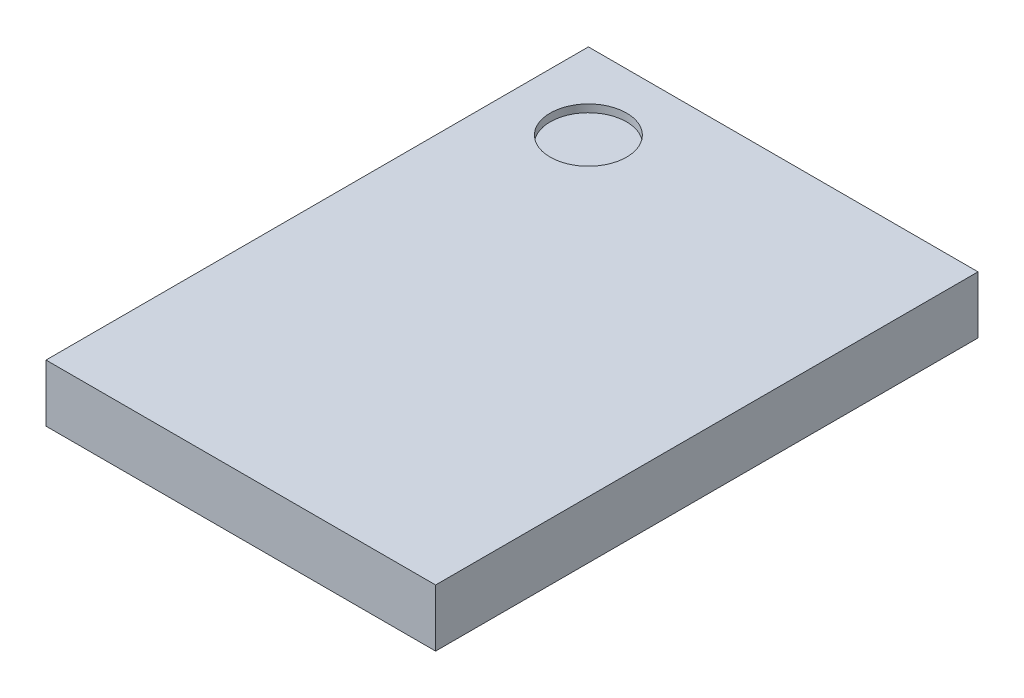
ISO-10303-21;
HEADER;
FILE_DESCRIPTION(('STEP AP214'),'2;1');
FILE_NAME('part.step','',(''),(''),'','','');
FILE_SCHEMA(('AUTOMOTIVE_DESIGN { 1 0 10303 214 1 1 1 1 }'));
ENDSEC;
DATA;
#1=APPLICATION_CONTEXT('core data for automotive mechanical design processes');
#2=APPLICATION_PROTOCOL_DEFINITION('international standard','automotive_design',2000,#1);
#3=PRODUCT_CONTEXT('',#1,'mechanical');
#4=PRODUCT('Part','Part','',(#3));
#5=PRODUCT_RELATED_PRODUCT_CATEGORY('part','',(#4));
#6=PRODUCT_DEFINITION_FORMATION('','',#4);
#7=PRODUCT_DEFINITION_CONTEXT('part definition',#1,'design');
#8=PRODUCT_DEFINITION('design','',#6,#7);
#9=PRODUCT_DEFINITION_SHAPE('','',#8);
#10=(LENGTH_UNIT() NAMED_UNIT(*) SI_UNIT(.MILLI.,.METRE.));
#11=(NAMED_UNIT(*) PLANE_ANGLE_UNIT() SI_UNIT($,.RADIAN.));
#12=(NAMED_UNIT(*) SI_UNIT($,.STERADIAN.) SOLID_ANGLE_UNIT());
#13=UNCERTAINTY_MEASURE_WITH_UNIT(LENGTH_MEASURE(1.E-05),#10,'distance_accuracy_value','');
#14=(GEOMETRIC_REPRESENTATION_CONTEXT(3) GLOBAL_UNCERTAINTY_ASSIGNED_CONTEXT((#13)) GLOBAL_UNIT_ASSIGNED_CONTEXT((#10,
#11,#12)) REPRESENTATION_CONTEXT('',''));
#15=CARTESIAN_POINT('',(0.,0.,0.));
#16=DIRECTION('',(0.,0.,1.));
#17=DIRECTION('',(1.,0.,0.));
#18=AXIS2_PLACEMENT_3D('',#15,#16,#17);
#19=CARTESIAN_POINT('',(2.55,0.75,3.55));
#20=DIRECTION('',(-1.,0.,0.));
#21=DIRECTION('',(0.,0.,1.));
#22=AXIS2_PLACEMENT_3D('',#19,#20,#21);
#23=PLANE('',#22);
#24=DIRECTION('',(0.,0.,-1.));
#25=VECTOR('',#24,1.);
#26=CARTESIAN_POINT('',(2.55,0.,3.55));
#27=LINE('',#26,#25);
#28=CARTESIAN_POINT('',(2.55,0.,3.55));
#29=VERTEX_POINT('',#28);
#30=CARTESIAN_POINT('',(2.55,0.,-3.55));
#31=VERTEX_POINT('',#30);
#32=EDGE_CURVE('E98',#29,#31,#27,.T.);
#33=ORIENTED_EDGE('',*,*,#32,.T.);
#34=DIRECTION('',(0.,-1.,0.));
#35=VECTOR('',#34,1.);
#36=CARTESIAN_POINT('',(2.55,0.75,-3.55));
#37=LINE('',#36,#35);
#38=CARTESIAN_POINT('',(2.55,0.75,-3.55));
#39=VERTEX_POINT('',#38);
#40=EDGE_CURVE('E11',#39,#31,#37,.T.);
#41=ORIENTED_EDGE('',*,*,#40,.F.);
#42=DIRECTION('',(0.,0.,-1.));
#43=VECTOR('',#42,1.);
#44=CARTESIAN_POINT('',(2.55,0.75,3.55));
#45=LINE('',#44,#43);
#46=CARTESIAN_POINT('',(2.55,0.75,3.55));
#47=VERTEX_POINT('',#46);
#48=EDGE_CURVE('E86',#47,#39,#45,.T.);
#49=ORIENTED_EDGE('',*,*,#48,.F.);
#50=DIRECTION('',(0.,-1.,0.));
#51=VECTOR('',#50,1.);
#52=CARTESIAN_POINT('',(2.55,0.75,3.55));
#53=LINE('',#52,#51);
#54=EDGE_CURVE('E94',#47,#29,#53,.T.);
#55=ORIENTED_EDGE('',*,*,#54,.T.);
#56=EDGE_LOOP('',(#33,#41,#49,#55));
#57=FACE_BOUND('',#56,.T.);
#58=ADVANCED_FACE('F35',(#57),#23,.F.);
#59=CARTESIAN_POINT('',(-2.55,0.75,-3.55));
#60=DIRECTION('',(0.,0.,1.));
#61=DIRECTION('',(1.,0.,0.));
#62=AXIS2_PLACEMENT_3D('',#59,#60,#61);
#63=PLANE('',#62);
#64=DIRECTION('',(-1.,0.,0.));
#65=VECTOR('',#64,1.);
#66=CARTESIAN_POINT('',(-2.55,0.,-3.55));
#67=LINE('',#66,#65);
#68=CARTESIAN_POINT('',(-2.55,0.,-3.55));
#69=VERTEX_POINT('',#68);
#70=EDGE_CURVE('E90',#31,#69,#67,.T.);
#71=ORIENTED_EDGE('',*,*,#70,.T.);
#72=DIRECTION('',(0.,-1.,0.));
#73=VECTOR('',#72,1.);
#74=CARTESIAN_POINT('',(-2.55,0.75,-3.55));
#75=LINE('',#74,#73);
#76=CARTESIAN_POINT('',(-2.55,0.75,-3.55));
#77=VERTEX_POINT('',#76);
#78=EDGE_CURVE('E43',#77,#69,#75,.T.);
#79=ORIENTED_EDGE('',*,*,#78,.F.);
#80=DIRECTION('',(-1.,0.,0.));
#81=VECTOR('',#80,1.);
#82=CARTESIAN_POINT('',(-2.55,0.75,-3.55));
#83=LINE('',#82,#81);
#84=EDGE_CURVE('E81',#39,#77,#83,.T.);
#85=ORIENTED_EDGE('',*,*,#84,.F.);
#86=ORIENTED_EDGE('',*,*,#40,.T.);
#87=EDGE_LOOP('',(#71,#79,#85,#86));
#88=FACE_BOUND('',#87,.T.);
#89=ADVANCED_FACE('F89',(#88),#63,.F.);
#90=CARTESIAN_POINT('',(-2.55,0.75,3.55));
#91=DIRECTION('',(1.,0.,0.));
#92=DIRECTION('',(0.,0.,-1.));
#93=AXIS2_PLACEMENT_3D('',#90,#91,#92);
#94=PLANE('',#93);
#95=DIRECTION('',(0.,0.,1.));
#96=VECTOR('',#95,1.);
#97=CARTESIAN_POINT('',(-2.55,0.,3.55));
#98=LINE('',#97,#96);
#99=CARTESIAN_POINT('',(-2.55,0.,3.55));
#100=VERTEX_POINT('',#99);
#101=EDGE_CURVE('E68',#69,#100,#98,.T.);
#102=ORIENTED_EDGE('',*,*,#101,.T.);
#103=DIRECTION('',(0.,-1.,0.));
#104=VECTOR('',#103,1.);
#105=CARTESIAN_POINT('',(-2.55,0.75,3.55));
#106=LINE('',#105,#104);
#107=CARTESIAN_POINT('',(-2.55,0.75,3.55));
#108=VERTEX_POINT('',#107);
#109=EDGE_CURVE('E91',#108,#100,#106,.T.);
#110=ORIENTED_EDGE('',*,*,#109,.F.);
#111=DIRECTION('',(0.,0.,1.));
#112=VECTOR('',#111,1.);
#113=CARTESIAN_POINT('',(-2.55,0.75,3.55));
#114=LINE('',#113,#112);
#115=EDGE_CURVE('E84',#77,#108,#114,.T.);
#116=ORIENTED_EDGE('',*,*,#115,.F.);
#117=ORIENTED_EDGE('',*,*,#78,.T.);
#118=EDGE_LOOP('',(#102,#110,#116,#117));
#119=FACE_BOUND('',#118,.T.);
#120=ADVANCED_FACE('F92',(#119),#94,.F.);
#121=CARTESIAN_POINT('',(-2.55,0.75,3.55));
#122=DIRECTION('',(0.,0.,-1.));
#123=DIRECTION('',(-1.,0.,0.));
#124=AXIS2_PLACEMENT_3D('',#121,#122,#123);
#125=PLANE('',#124);
#126=DIRECTION('',(1.,0.,0.));
#127=VECTOR('',#126,1.);
#128=CARTESIAN_POINT('',(-2.55,0.,3.55));
#129=LINE('',#128,#127);
#130=EDGE_CURVE('E74',#100,#29,#129,.T.);
#131=ORIENTED_EDGE('',*,*,#130,.T.);
#132=ORIENTED_EDGE('',*,*,#54,.F.);
#133=DIRECTION('',(1.,0.,0.));
#134=VECTOR('',#133,1.);
#135=CARTESIAN_POINT('',(-2.55,0.75,3.55));
#136=LINE('',#135,#134);
#137=EDGE_CURVE('E51',#108,#47,#136,.T.);
#138=ORIENTED_EDGE('',*,*,#137,.F.);
#139=ORIENTED_EDGE('',*,*,#109,.T.);
#140=EDGE_LOOP('',(#131,#132,#138,#139));
#141=FACE_BOUND('',#140,.T.);
#142=ADVANCED_FACE('F106',(#141),#125,.F.);
#143=CARTESIAN_POINT('',(0.,0.75,0.));
#144=DIRECTION('',(0.,-1.,0.));
#145=DIRECTION('',(0.,0.,-1.));
#146=AXIS2_PLACEMENT_3D('',#143,#144,#145);
#147=PLANE('',#146);
#148=CARTESIAN_POINT('',(-1.55,0.75,-2.55));
#149=DIRECTION('',(0.,1.,0.));
#150=DIRECTION('',(0.,0.,1.));
#151=AXIS2_PLACEMENT_3D('',#148,#149,#150);
#152=CIRCLE('',#151,0.5);
#153=CARTESIAN_POINT('',(-1.55,0.75,-2.05));
#154=VERTEX_POINT('',#153);
#155=EDGE_CURVE('E112',#154,#154,#152,.T.);
#156=ORIENTED_EDGE('',*,*,#155,.F.);
#157=EDGE_LOOP('',(#156));
#158=FACE_BOUND('',#157,.T.);
#159=ORIENTED_EDGE('',*,*,#48,.T.);
#160=ORIENTED_EDGE('',*,*,#84,.T.);
#161=ORIENTED_EDGE('',*,*,#115,.T.);
#162=ORIENTED_EDGE('',*,*,#137,.T.);
#163=EDGE_LOOP('',(#159,#160,#161,#162));
#164=FACE_BOUND('',#163,.T.);
#165=ADVANCED_FACE('F82',(#158,#164),#147,.F.);
#166=CARTESIAN_POINT('',(0.,0.,0.));
#167=DIRECTION('',(0.,-1.,0.));
#168=DIRECTION('',(0.,0.,-1.));
#169=AXIS2_PLACEMENT_3D('',#166,#167,#168);
#170=PLANE('',#169);
#171=ORIENTED_EDGE('',*,*,#32,.F.);
#172=ORIENTED_EDGE('',*,*,#130,.F.);
#173=ORIENTED_EDGE('',*,*,#101,.F.);
#174=ORIENTED_EDGE('',*,*,#70,.F.);
#175=EDGE_LOOP('',(#171,#172,#173,#174));
#176=FACE_BOUND('',#175,.T.);
#177=ADVANCED_FACE('F109',(#176),#170,.T.);
#178=CARTESIAN_POINT('',(-1.55,0.65,-2.55));
#179=DIRECTION('',(0.,1.,0.));
#180=DIRECTION('',(0.,0.,1.));
#181=AXIS2_PLACEMENT_3D('',#178,#179,#180);
#182=CYLINDRICAL_SURFACE('',#181,0.5);
#183=CARTESIAN_POINT('',(-1.55,0.65,-2.55));
#184=DIRECTION('',(0.,1.,0.));
#185=DIRECTION('',(0.,0.,1.));
#186=AXIS2_PLACEMENT_3D('',#183,#184,#185);
#187=CIRCLE('',#186,0.5);
#188=CARTESIAN_POINT('',(-1.55,0.65,-2.05));
#189=VERTEX_POINT('',#188);
#190=EDGE_CURVE('E101',#189,#189,#187,.T.);
#191=ORIENTED_EDGE('',*,*,#190,.F.);
#192=EDGE_LOOP('',(#191));
#193=FACE_BOUND('',#192,.T.);
#194=ORIENTED_EDGE('',*,*,#155,.T.);
#195=EDGE_LOOP('',(#194));
#196=FACE_BOUND('',#195,.T.);
#197=ADVANCED_FACE('F120',(#193,#196),#182,.F.);
#198=CARTESIAN_POINT('',(-1.55,0.65,-2.55));
#199=DIRECTION('',(0.,1.,0.));
#200=DIRECTION('',(0.,0.,1.));
#201=AXIS2_PLACEMENT_3D('',#198,#199,#200);
#202=PLANE('',#201);
#203=ORIENTED_EDGE('',*,*,#190,.T.);
#204=EDGE_LOOP('',(#203));
#205=FACE_BOUND('',#204,.T.);
#206=ADVANCED_FACE('F118',(#205),#202,.T.);
#207=CLOSED_SHELL('',(#58,#89,#120,#142,#165,#177,#197,#206));
#208=MANIFOLD_SOLID_BREP('B2',#207);
#209=ADVANCED_BREP_SHAPE_REPRESENTATION('',(#18,#208),#14);
#210=SHAPE_DEFINITION_REPRESENTATION(#9,#209);
ENDSEC;
END-ISO-10303-21;
